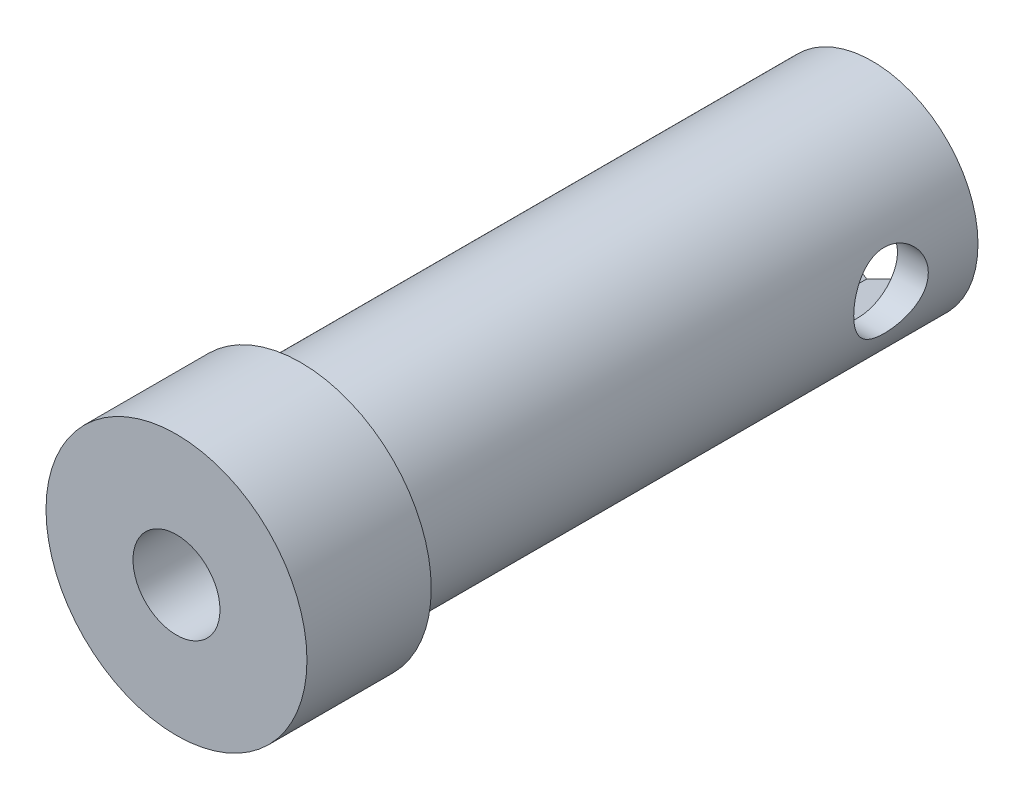
ISO-10303-21;
HEADER;
FILE_DESCRIPTION(('STEP AP214'),'2;1');
FILE_NAME('part.step','',(''),(''),'','','');
FILE_SCHEMA(('AUTOMOTIVE_DESIGN { 1 0 10303 214 1 1 1 1 }'));
ENDSEC;
DATA;
#1=APPLICATION_CONTEXT('core data for automotive mechanical design processes');
#2=APPLICATION_PROTOCOL_DEFINITION('international standard','automotive_design',2000,#1);
#3=PRODUCT_CONTEXT('',#1,'mechanical');
#4=PRODUCT('Part','Part','',(#3));
#5=PRODUCT_RELATED_PRODUCT_CATEGORY('part','',(#4));
#6=PRODUCT_DEFINITION_FORMATION('','',#4);
#7=PRODUCT_DEFINITION_CONTEXT('part definition',#1,'design');
#8=PRODUCT_DEFINITION('design','',#6,#7);
#9=PRODUCT_DEFINITION_SHAPE('','',#8);
#10=(LENGTH_UNIT() NAMED_UNIT(*) SI_UNIT(.MILLI.,.METRE.));
#11=(NAMED_UNIT(*) PLANE_ANGLE_UNIT() SI_UNIT($,.RADIAN.));
#12=(NAMED_UNIT(*) SI_UNIT($,.STERADIAN.) SOLID_ANGLE_UNIT());
#13=UNCERTAINTY_MEASURE_WITH_UNIT(LENGTH_MEASURE(1.E-05),#10,'distance_accuracy_value','');
#14=(GEOMETRIC_REPRESENTATION_CONTEXT(3) GLOBAL_UNCERTAINTY_ASSIGNED_CONTEXT((#13)) GLOBAL_UNIT_ASSIGNED_CONTEXT((#10,
#11,#12)) REPRESENTATION_CONTEXT('',''));
#15=CARTESIAN_POINT('',(0.,0.,0.));
#16=DIRECTION('',(0.,0.,1.));
#17=DIRECTION('',(1.,0.,0.));
#18=AXIS2_PLACEMENT_3D('',#15,#16,#17);
#19=CARTESIAN_POINT('',(2.25,0.,3.5));
#20=DIRECTION('',(1.,0.,0.));
#21=DIRECTION('',(0.,0.,-1.));
#22=AXIS2_PLACEMENT_3D('',#19,#20,#21);
#23=CYLINDRICAL_SURFACE('',#22,1.5);
#24=CARTESIAN_POINT('',(4.25,0.,2.));
#25=CARTESIAN_POINT('',(4.2500010209157,-0.0815655083667399,1.99999856055464));
#26=CARTESIAN_POINT('',(4.24763079702054,-0.163120739629342,2.00667422553748));
#27=CARTESIAN_POINT('',(4.23841044575562,-0.323812547744015,2.03310686808062));
#28=CARTESIAN_POINT('',(4.2315603770681,-0.40294915626383,2.05286367428883));
#29=CARTESIAN_POINT('',(4.2141205688639,-0.556463868995197,2.10468550707371));
#30=CARTESIAN_POINT('',(4.20353753046498,-0.630850219721872,2.1367284874404));
#31=CARTESIAN_POINT('',(4.17969988413846,-0.773190539787241,2.21210770256198));
#32=CARTESIAN_POINT('',(4.16644465546129,-0.841143009135492,2.25544656203501));
#33=CARTESIAN_POINT('',(4.13807832016637,-0.971287267748924,2.35392503513446));
#34=CARTESIAN_POINT('',(4.12291896125755,-1.03319941604949,2.40942020509824));
#35=CARTESIAN_POINT('',(4.09270521060981,-1.14705732806969,2.52988075550396));
#36=CARTESIAN_POINT('',(4.07765084685791,-1.19900052552279,2.59484856689561));
#37=CARTESIAN_POINT('',(4.04880698686655,-1.29312427720224,2.73502531902265));
#38=CARTESIAN_POINT('',(4.03507546976457,-1.33492700758018,2.81050105617882));
#39=CARTESIAN_POINT('',(4.01117354628646,-1.40512349822382,2.96797398290292));
#40=CARTESIAN_POINT('',(4.0010019017598,-1.43352192180918,3.0499688928526));
#41=CARTESIAN_POINT('',(3.9858829929351,-1.4750292626899,3.21495257475405));
#42=CARTESIAN_POINT('',(3.98075571416019,-1.48866689411975,3.29779131424751));
#43=CARTESIAN_POINT('',(3.97577601517782,-1.50191880713281,3.46472780803681));
#44=CARTESIAN_POINT('',(3.97592172401636,-1.50153806269545,3.54882510518631));
#45=CARTESIAN_POINT('',(3.98131493672348,-1.48717164738301,3.71123772076156));
#46=CARTESIAN_POINT('',(3.98629652758993,-1.4738950639563,3.78962617210374));
#47=CARTESIAN_POINT('',(4.00036197260984,-1.43527767348311,3.94298148847549));
#48=CARTESIAN_POINT('',(4.00944637437166,-1.40993525596706,4.01794789528844));
#49=CARTESIAN_POINT('',(4.03086961718048,-1.3474763669417,4.16386558763031));
#50=CARTESIAN_POINT('',(4.04326253509493,-1.31016195807023,4.23472386186851));
#51=CARTESIAN_POINT('',(4.06988590478,-1.22495586763456,4.36938885625305));
#52=CARTESIAN_POINT('',(4.0841169363794,-1.17706084503886,4.43319333945964));
#53=CARTESIAN_POINT('',(4.11383840224644,-1.06872139550984,4.55589788426286));
#54=CARTESIAN_POINT('',(4.12935360736949,-1.00770334727961,4.61428660951452));
#55=CARTESIAN_POINT('',(4.15916674047781,-0.87655524485976,4.72014470411396));
#56=CARTESIAN_POINT('',(4.17346452155981,-0.806424093588433,4.76761275686643));
#57=CARTESIAN_POINT('',(4.19946112552831,-0.657856192770663,4.85076159279324));
#58=CARTESIAN_POINT('',(4.2111258238281,-0.57932790724254,4.88629023618163));
#59=CARTESIAN_POINT('',(4.23029207791539,-0.416896876801657,4.94346879686703));
#60=CARTESIAN_POINT('',(4.23779526295093,-0.332996249551294,4.96512414612633));
#61=CARTESIAN_POINT('',(4.24751560494482,-0.166519502448814,4.99300043312357));
#62=CARTESIAN_POINT('',(4.24996881305308,-0.0840725378489703,4.99991118536298));
#63=CARTESIAN_POINT('',(4.25003056815402,0.0808289065776154,5.00008706130313));
#64=CARTESIAN_POINT('',(4.24764004701629,0.16328338190766,4.99335480973774));
#65=CARTESIAN_POINT('',(4.23843896402726,0.322998150286772,4.96697244574822));
#66=CARTESIAN_POINT('',(4.2317778102469,0.400340003859341,4.94775870798081));
#67=CARTESIAN_POINT('',(4.21485447662064,0.550661054195005,4.8975175507092));
#68=CARTESIAN_POINT('',(4.2045918300867,0.623639684128512,4.86648860012371));
#69=CARTESIAN_POINT('',(4.18113823249899,0.765437512588099,4.79254683615763));
#70=CARTESIAN_POINT('',(4.16787357328707,0.83408386613518,4.74932662914232));
#71=CARTESIAN_POINT('',(4.13990428237041,0.963366301782212,4.65258363079006));
#72=CARTESIAN_POINT('',(4.12519916677669,1.02399967592259,4.59905737149549));
#73=CARTESIAN_POINT('',(4.09504516039956,1.1387745474265,4.47998676439197));
#74=CARTESIAN_POINT('',(4.07959674847471,1.19242452115109,4.41396730711688));
#75=CARTESIAN_POINT('',(4.05045147474101,1.28796171668791,4.27354094799443));
#76=CARTESIAN_POINT('',(4.03675468400403,1.32984846129056,4.19913370604378));
#77=CARTESIAN_POINT('',(4.01276844860528,1.4005686030219,4.0437752419884));
#78=CARTESIAN_POINT('',(4.00248050035801,1.42939626950676,3.96282116530054));
#79=CARTESIAN_POINT('',(3.98669663677319,1.47285262752334,3.79675197037676));
#80=CARTESIAN_POINT('',(3.98119820675466,1.48748877060707,3.71163906050976));
#81=CARTESIAN_POINT('',(3.97592446271836,1.50152432708597,3.54492428134057));
#82=CARTESIAN_POINT('',(3.97583895136912,1.50174959096592,3.46340106714258));
#83=CARTESIAN_POINT('',(3.98062071938137,1.48902781764758,3.30154470015525));
#84=CARTESIAN_POINT('',(3.98548763101594,1.47608175844535,3.2212114594574));
#85=CARTESIAN_POINT('',(3.99938188223679,1.43799776805892,3.06594631621966));
#86=CARTESIAN_POINT('',(4.00830695183632,1.41315878004889,2.99093118905349));
#87=CARTESIAN_POINT('',(4.02926366752764,1.35224508551621,2.84608065020138));
#88=CARTESIAN_POINT('',(4.04129605143985,1.31616771005937,2.77624647378978));
#89=CARTESIAN_POINT('',(4.06782868650947,1.2317922005138,2.64011395168267));
#90=CARTESIAN_POINT('',(4.08241946444022,1.18299198034395,2.57414460356139));
#91=CARTESIAN_POINT('',(4.11207835247002,1.07537148164594,2.45106566697635));
#92=CARTESIAN_POINT('',(4.12714660409913,1.01654820909136,2.39395873560887));
#93=CARTESIAN_POINT('',(4.15688911811243,0.887332086427621,2.28758197879441));
#94=CARTESIAN_POINT('',(4.17151395756386,0.816533541295918,2.23878919099604));
#95=CARTESIAN_POINT('',(4.19797905376782,0.667240948186923,2.15383410720403));
#96=CARTESIAN_POINT('',(4.20981961499931,0.588747743002239,2.11767042992483));
#97=CARTESIAN_POINT('',(4.22931721412351,0.426619084687958,2.0593824576653));
#98=CARTESIAN_POINT('',(4.23699362671968,0.343009496069278,2.03719306491401));
#99=CARTESIAN_POINT('',(4.24733355773892,0.172928713785267,2.00750529765388));
#100=CARTESIAN_POINT('',(4.24999891784007,0.0864585833297923,2.00000152579698));
#101=CARTESIAN_POINT('',(4.25,0.,2.));
#102=B_SPLINE_CURVE_WITH_KNOTS('',3,(#24,#25,#26,#27,#28,#29,#30,#31,#32,#33,#34,#35,#36,#37,
#38,#39,#40,#41,#42,#43,#44,#45,#46,#47,#48,#49,#50,#51,#52,#53,#54,#55,#56,#57,#58,#59,#60,#61,
#62,#63,#64,#65,#66,#67,#68,#69,#70,#71,#72,#73,#74,#75,#76,#77,#78,#79,#80,#81,#82,#83,#84,#85,
#86,#87,#88,#89,#90,#91,#92,#93,#94,#95,#96,#97,#98,#99,#100,#101),.UNSPECIFIED.,.T.,.F.,(4,2,2,
2,2,2,2,2,2,2,2,2,2,2,2,2,2,2,2,2,2,2,2,2,2,2,2,2,2,2,2,2,2,2,2,2,2,2,4),(0.,0.244378011015888,
0.488752820946186,0.732691163485121,0.976686238313035,1.22909954192451,1.48157773636689,
1.74237029797326,2.00307206360573,2.25409069161506,2.5050202544238,2.74289041367082,
2.98079233119384,3.22284994005456,3.46498409277591,3.72140166887643,3.97785014247673,
4.23745243599866,4.49695302237793,4.74401979264808,4.99103903504467,5.22985573929486,
5.46870340128573,5.71421460975224,5.95980857688843,6.21798068295958,6.47616326101998,
6.73445902643867,6.99261909477785,7.23597058627499,7.47930400977472,7.716818677586,
7.95438979432423,8.20332669356905,8.45233808454076,8.7127219459576,8.97307731944662,
9.23221070401172,9.49124883241259),.UNSPECIFIED.);
#103=CARTESIAN_POINT('',(4.25,0.,2.));
#104=VERTEX_POINT('',#103);
#105=EDGE_CURVE('E49',#104,#104,#102,.T.);
#106=ORIENTED_EDGE('',*,*,#105,.F.);
#107=EDGE_LOOP('',(#106));
#108=FACE_BOUND('',#107,.T.);
#109=DIRECTION('',(1.,0.,0.));
#110=VECTOR('',#109,1.);
#111=CARTESIAN_POINT('',(2.25,1.41421356237309,4.));
#112=LINE('',#111,#110);
#113=CARTESIAN_POINT('',(3.09975873007064,1.41421356237309,4.));
#114=VERTEX_POINT('',#113);
#115=CARTESIAN_POINT('',(2.25,1.41421356237309,4.));
#116=VERTEX_POINT('',#115);
#117=EDGE_CURVE('E64',#114,#116,#112,.F.);
#118=ORIENTED_EDGE('',*,*,#117,.F.);
#119=CARTESIAN_POINT('',(3.00651387980422,0.,3.5));
#120=DIRECTION('',(0.997833411031967,-0.0657912139142378,0.));
#121=DIRECTION('',(0.0657912139142378,0.997833411031967,0.));
#122=AXIS2_PLACEMENT_3D('',#119,#120,#121);
#123=ELLIPSE('',#122,1.50325693990211,1.5);
#124=CARTESIAN_POINT('',(2.9132690295378,-1.4142135623731,4.));
#125=VERTEX_POINT('',#124);
#126=EDGE_CURVE('E11',#114,#125,#123,.F.);
#127=ORIENTED_EDGE('',*,*,#126,.T.);
#128=DIRECTION('',(1.,0.,0.));
#129=VECTOR('',#128,1.);
#130=CARTESIAN_POINT('',(2.25,-1.4142135623731,4.));
#131=LINE('',#130,#129);
#132=CARTESIAN_POINT('',(2.25,-1.4142135623731,4.));
#133=VERTEX_POINT('',#132);
#134=EDGE_CURVE('E182',#133,#125,#131,.T.);
#135=ORIENTED_EDGE('',*,*,#134,.F.);
#136=CARTESIAN_POINT('',(2.25,0.,3.5));
#137=DIRECTION('',(1.,0.,0.));
#138=DIRECTION('',(0.,0.,-1.));
#139=AXIS2_PLACEMENT_3D('',#136,#137,#138);
#140=CIRCLE('',#139,1.5);
#141=EDGE_CURVE('E191',#116,#133,#140,.T.);
#142=ORIENTED_EDGE('',*,*,#141,.F.);
#143=EDGE_LOOP('',(#118,#127,#135,#142));
#144=FACE_BOUND('',#143,.T.);
#145=ADVANCED_FACE('F39',(#108,#144),#23,.F.);
#146=CARTESIAN_POINT('',(2.25,0.,3.5));
#147=DIRECTION('',(1.,0.,0.));
#148=DIRECTION('',(0.,0.,-1.));
#149=AXIS2_PLACEMENT_3D('',#146,#147,#148);
#150=PLANE('',#149);
#151=ORIENTED_EDGE('',*,*,#141,.T.);
#152=DIRECTION('',(0.,1.,0.));
#153=VECTOR('',#152,1.);
#154=CARTESIAN_POINT('',(2.25,0.,4.));
#155=LINE('',#154,#153);
#156=EDGE_CURVE('E179',#133,#116,#155,.T.);
#157=ORIENTED_EDGE('',*,*,#156,.T.);
#158=EDGE_LOOP('',(#151,#157));
#159=FACE_BOUND('',#158,.T.);
#160=ADVANCED_FACE('F221',(#159),#150,.T.);
#161=CARTESIAN_POINT('',(0.,0.,0.));
#162=DIRECTION('',(0.,0.,1.));
#163=DIRECTION('',(1.,0.,0.));
#164=AXIS2_PLACEMENT_3D('',#161,#162,#163);
#165=CYLINDRICAL_SURFACE('',#164,1.75);
#166=CARTESIAN_POINT('',(0.,0.,28.));
#167=DIRECTION('',(0.,0.,1.));
#168=DIRECTION('',(1.,0.,0.));
#169=AXIS2_PLACEMENT_3D('',#166,#167,#168);
#170=CIRCLE('',#169,1.75);
#171=CARTESIAN_POINT('',(1.75,0.,28.));
#172=VERTEX_POINT('',#171);
#173=EDGE_CURVE('E187',#172,#172,#170,.T.);
#174=ORIENTED_EDGE('',*,*,#173,.T.);
#175=EDGE_LOOP('',(#174));
#176=FACE_BOUND('',#175,.T.);
#177=CARTESIAN_POINT('',(0.,0.,4.));
#178=DIRECTION('',(0.,0.,-1.));
#179=DIRECTION('',(-1.,0.,0.));
#180=AXIS2_PLACEMENT_3D('',#177,#178,#179);
#181=CIRCLE('',#180,1.75);
#182=CARTESIAN_POINT('',(-1.75,0.,4.));
#183=VERTEX_POINT('',#182);
#184=EDGE_CURVE('E167',#183,#183,#181,.F.);
#185=ORIENTED_EDGE('',*,*,#184,.F.);
#186=EDGE_LOOP('',(#185));
#187=FACE_BOUND('',#186,.T.);
#188=ADVANCED_FACE('F242',(#176,#187),#165,.F.);
#189=CARTESIAN_POINT('',(0.,0.,23.));
#190=DIRECTION('',(0.,0.,-1.));
#191=DIRECTION('',(-1.,0.,0.));
#192=AXIS2_PLACEMENT_3D('',#189,#190,#191);
#193=CYLINDRICAL_SURFACE('',#192,4.25);
#194=ORIENTED_EDGE('',*,*,#105,.T.);
#195=EDGE_LOOP('',(#194));
#196=FACE_BOUND('',#195,.T.);
#197=CARTESIAN_POINT('',(0.,0.,23.));
#198=DIRECTION('',(0.,0.,1.));
#199=DIRECTION('',(1.,0.,0.));
#200=AXIS2_PLACEMENT_3D('',#197,#198,#199);
#201=CIRCLE('',#200,4.25);
#202=CARTESIAN_POINT('',(4.25,0.,23.));
#203=VERTEX_POINT('',#202);
#204=EDGE_CURVE('E204',#203,#203,#201,.T.);
#205=ORIENTED_EDGE('',*,*,#204,.F.);
#206=EDGE_LOOP('',(#205));
#207=FACE_BOUND('',#206,.T.);
#208=CARTESIAN_POINT('',(0.,0.,0.));
#209=DIRECTION('',(0.,0.,1.));
#210=DIRECTION('',(1.,0.,0.));
#211=AXIS2_PLACEMENT_3D('',#208,#209,#210);
#212=CIRCLE('',#211,4.25);
#213=CARTESIAN_POINT('',(4.25,0.,0.));
#214=VERTEX_POINT('',#213);
#215=EDGE_CURVE('E200',#214,#214,#212,.T.);
#216=ORIENTED_EDGE('',*,*,#215,.T.);
#217=EDGE_LOOP('',(#216));
#218=FACE_BOUND('',#217,.T.);
#219=ADVANCED_FACE('F41',(#196,#207,#218),#193,.T.);
#220=CARTESIAN_POINT('',(0.,0.,0.));
#221=DIRECTION('',(0.,0.,1.));
#222=DIRECTION('',(1.,0.,0.));
#223=AXIS2_PLACEMENT_3D('',#220,#221,#222);
#224=PLANE('',#223);
#225=DIRECTION('',(0.831253475741444,-0.55589356811153,0.));
#226=VECTOR('',#225,1.);
#227=CARTESIAN_POINT('',(0.227907450382186,3.45659633079425,0.));
#228=LINE('',#227,#226);
#229=CARTESIAN_POINT('',(0.227907450382186,3.45659633079425,0.));
#230=VERTEX_POINT('',#229);
#231=CARTESIAN_POINT('',(3.107453958287,1.53092452365441,0.));
#232=VERTEX_POINT('',#231);
#233=EDGE_CURVE('E150',#230,#232,#228,.T.);
#234=ORIENTED_EDGE('',*,*,#233,.F.);
#235=DIRECTION('',(0.897044689655682,0.441939842920437,0.));
#236=VECTOR('',#235,1.);
#237=CARTESIAN_POINT('',(-2.87954650790481,1.92567180713984,0.));
#238=LINE('',#237,#236);
#239=CARTESIAN_POINT('',(-2.87954650790481,1.92567180713984,0.));
#240=VERTEX_POINT('',#239);
#241=EDGE_CURVE('E56',#240,#230,#238,.T.);
#242=ORIENTED_EDGE('',*,*,#241,.F.);
#243=DIRECTION('',(0.0657912139142379,0.997833411031967,0.));
#244=VECTOR('',#243,1.);
#245=CARTESIAN_POINT('',(-3.10745395828699,-1.53092452365441,0.));
#246=LINE('',#245,#244);
#247=CARTESIAN_POINT('',(-3.10745395828699,-1.53092452365441,0.));
#248=VERTEX_POINT('',#247);
#249=EDGE_CURVE('E129',#248,#240,#246,.T.);
#250=ORIENTED_EDGE('',*,*,#249,.F.);
#251=DIRECTION('',(-0.831253475741444,0.55589356811153,0.));
#252=VECTOR('',#251,1.);
#253=CARTESIAN_POINT('',(-0.227907450382184,-3.45659633079425,0.));
#254=LINE('',#253,#252);
#255=CARTESIAN_POINT('',(-0.227907450382184,-3.45659633079425,0.));
#256=VERTEX_POINT('',#255);
#257=EDGE_CURVE('E133',#256,#248,#254,.T.);
#258=ORIENTED_EDGE('',*,*,#257,.F.);
#259=DIRECTION('',(-0.897044689655682,-0.441939842920437,0.));
#260=VECTOR('',#259,1.);
#261=CARTESIAN_POINT('',(2.87954650790481,-1.92567180713984,0.));
#262=LINE('',#261,#260);
#263=CARTESIAN_POINT('',(2.87954650790481,-1.92567180713984,0.));
#264=VERTEX_POINT('',#263);
#265=EDGE_CURVE('E157',#264,#256,#262,.T.);
#266=ORIENTED_EDGE('',*,*,#265,.F.);
#267=DIRECTION('',(-0.0657912139142378,-0.997833411031967,0.));
#268=VECTOR('',#267,1.);
#269=CARTESIAN_POINT('',(3.107453958287,1.53092452365441,0.));
#270=LINE('',#269,#268);
#271=EDGE_CURVE('E153',#232,#264,#270,.T.);
#272=ORIENTED_EDGE('',*,*,#271,.F.);
#273=EDGE_LOOP('',(#234,#242,#250,#258,#266,#272));
#274=FACE_BOUND('',#273,.T.);
#275=ORIENTED_EDGE('',*,*,#215,.F.);
#276=EDGE_LOOP('',(#275));
#277=FACE_BOUND('',#276,.T.);
#278=ADVANCED_FACE('F235',(#274,#277),#224,.F.);
#279=CARTESIAN_POINT('',(0.,0.,28.));
#280=DIRECTION('',(0.,0.,-1.));
#281=DIRECTION('',(-1.,0.,0.));
#282=AXIS2_PLACEMENT_3D('',#279,#280,#281);
#283=CYLINDRICAL_SURFACE('',#282,5.25);
#284=CARTESIAN_POINT('',(0.,0.,28.));
#285=DIRECTION('',(0.,0.,1.));
#286=DIRECTION('',(1.,0.,0.));
#287=AXIS2_PLACEMENT_3D('',#284,#285,#286);
#288=CIRCLE('',#287,5.25);
#289=CARTESIAN_POINT('',(5.25,0.,28.));
#290=VERTEX_POINT('',#289);
#291=EDGE_CURVE('E196',#290,#290,#288,.T.);
#292=ORIENTED_EDGE('',*,*,#291,.F.);
#293=EDGE_LOOP('',(#292));
#294=FACE_BOUND('',#293,.T.);
#295=CARTESIAN_POINT('',(0.,0.,23.));
#296=DIRECTION('',(0.,0.,1.));
#297=DIRECTION('',(1.,0.,0.));
#298=AXIS2_PLACEMENT_3D('',#295,#296,#297);
#299=CIRCLE('',#298,5.25);
#300=CARTESIAN_POINT('',(5.25,0.,23.));
#301=VERTEX_POINT('',#300);
#302=EDGE_CURVE('E195',#301,#301,#299,.T.);
#303=ORIENTED_EDGE('',*,*,#302,.T.);
#304=EDGE_LOOP('',(#303));
#305=FACE_BOUND('',#304,.T.);
#306=ADVANCED_FACE('F228',(#294,#305),#283,.T.);
#307=CARTESIAN_POINT('',(0.,0.,28.));
#308=DIRECTION('',(0.,0.,1.));
#309=DIRECTION('',(1.,0.,0.));
#310=AXIS2_PLACEMENT_3D('',#307,#308,#309);
#311=PLANE('',#310);
#312=ORIENTED_EDGE('',*,*,#173,.F.);
#313=EDGE_LOOP('',(#312));
#314=FACE_BOUND('',#313,.T.);
#315=ORIENTED_EDGE('',*,*,#291,.T.);
#316=EDGE_LOOP('',(#315));
#317=FACE_BOUND('',#316,.T.);
#318=ADVANCED_FACE('F224',(#314,#317),#311,.T.);
#319=CARTESIAN_POINT('',(0.,0.,23.));
#320=DIRECTION('',(0.,0.,1.));
#321=DIRECTION('',(1.,0.,0.));
#322=AXIS2_PLACEMENT_3D('',#319,#320,#321);
#323=PLANE('',#322);
#324=ORIENTED_EDGE('',*,*,#204,.T.);
#325=EDGE_LOOP('',(#324));
#326=FACE_BOUND('',#325,.T.);
#327=ORIENTED_EDGE('',*,*,#302,.F.);
#328=EDGE_LOOP('',(#327));
#329=FACE_BOUND('',#328,.T.);
#330=ADVANCED_FACE('F227',(#326,#329),#323,.F.);
#331=CARTESIAN_POINT('',(3.107453958287,1.53092452365441,4.));
#332=DIRECTION('',(0.997833411031967,-0.0657912139142378,0.));
#333=DIRECTION('',(0.0657912139142378,0.997833411031967,0.));
#334=AXIS2_PLACEMENT_3D('',#331,#332,#333);
#335=PLANE('',#334);
#336=DIRECTION('',(-0.0657912139142378,-0.997833411031967,0.));
#337=VECTOR('',#336,1.);
#338=CARTESIAN_POINT('',(3.107453958287,1.53092452365441,4.));
#339=LINE('',#338,#337);
#340=CARTESIAN_POINT('',(3.107453958287,1.53092452365441,4.));
#341=VERTEX_POINT('',#340);
#342=EDGE_CURVE('E136',#341,#114,#339,.T.);
#343=ORIENTED_EDGE('',*,*,#342,.F.);
#344=DIRECTION('',(0.,0.,-1.));
#345=VECTOR('',#344,1.);
#346=CARTESIAN_POINT('',(3.107453958287,1.53092452365441,4.));
#347=LINE('',#346,#345);
#348=EDGE_CURVE('E115',#341,#232,#347,.T.);
#349=ORIENTED_EDGE('',*,*,#348,.T.);
#350=ORIENTED_EDGE('',*,*,#271,.T.);
#351=DIRECTION('',(0.,0.,-1.));
#352=VECTOR('',#351,1.);
#353=CARTESIAN_POINT('',(2.87954650790481,-1.92567180713984,4.));
#354=LINE('',#353,#352);
#355=CARTESIAN_POINT('',(2.87954650790481,-1.92567180713984,4.));
#356=VERTEX_POINT('',#355);
#357=EDGE_CURVE('E174',#356,#264,#354,.T.);
#358=ORIENTED_EDGE('',*,*,#357,.F.);
#359=EDGE_CURVE('E123',#125,#356,#339,.T.);
#360=ORIENTED_EDGE('',*,*,#359,.F.);
#361=ORIENTED_EDGE('',*,*,#126,.F.);
#362=EDGE_LOOP('',(#343,#349,#350,#358,#360,#361));
#363=FACE_BOUND('',#362,.T.);
#364=ADVANCED_FACE('F232',(#363),#335,.F.);
#365=CARTESIAN_POINT('',(0.,0.,4.));
#366=DIRECTION('',(0.,0.,-1.));
#367=DIRECTION('',(-1.,0.,0.));
#368=AXIS2_PLACEMENT_3D('',#365,#366,#367);
#369=PLANE('',#368);
#370=ORIENTED_EDGE('',*,*,#184,.T.);
#371=EDGE_LOOP('',(#370));
#372=FACE_BOUND('',#371,.T.);
#373=ORIENTED_EDGE('',*,*,#117,.T.);
#374=ORIENTED_EDGE('',*,*,#156,.F.);
#375=ORIENTED_EDGE('',*,*,#134,.T.);
#376=ORIENTED_EDGE('',*,*,#359,.T.);
#377=DIRECTION('',(-0.897044689655682,-0.441939842920437,0.));
#378=VECTOR('',#377,1.);
#379=CARTESIAN_POINT('',(2.87954650790481,-1.92567180713984,4.));
#380=LINE('',#379,#378);
#381=CARTESIAN_POINT('',(-0.227907450382184,-3.45659633079425,4.));
#382=VERTEX_POINT('',#381);
#383=EDGE_CURVE('E139',#356,#382,#380,.T.);
#384=ORIENTED_EDGE('',*,*,#383,.T.);
#385=DIRECTION('',(-0.831253475741444,0.55589356811153,0.));
#386=VECTOR('',#385,1.);
#387=CARTESIAN_POINT('',(-0.227907450382184,-3.45659633079425,4.));
#388=LINE('',#387,#386);
#389=CARTESIAN_POINT('',(-3.10745395828699,-1.53092452365441,4.));
#390=VERTEX_POINT('',#389);
#391=EDGE_CURVE('E143',#382,#390,#388,.T.);
#392=ORIENTED_EDGE('',*,*,#391,.T.);
#393=DIRECTION('',(0.0657912139142379,0.997833411031967,0.));
#394=VECTOR('',#393,1.);
#395=CARTESIAN_POINT('',(-3.10745395828699,-1.53092452365441,4.));
#396=LINE('',#395,#394);
#397=CARTESIAN_POINT('',(-2.87954650790481,1.92567180713984,4.));
#398=VERTEX_POINT('',#397);
#399=EDGE_CURVE('E116',#390,#398,#396,.T.);
#400=ORIENTED_EDGE('',*,*,#399,.T.);
#401=DIRECTION('',(0.897044689655682,0.441939842920437,0.));
#402=VECTOR('',#401,1.);
#403=CARTESIAN_POINT('',(-2.87954650790481,1.92567180713984,4.));
#404=LINE('',#403,#402);
#405=CARTESIAN_POINT('',(0.227907450382186,3.45659633079425,4.));
#406=VERTEX_POINT('',#405);
#407=EDGE_CURVE('E109',#398,#406,#404,.T.);
#408=ORIENTED_EDGE('',*,*,#407,.T.);
#409=DIRECTION('',(0.831253475741444,-0.55589356811153,0.));
#410=VECTOR('',#409,1.);
#411=CARTESIAN_POINT('',(0.227907450382186,3.45659633079425,4.));
#412=LINE('',#411,#410);
#413=EDGE_CURVE('E119',#406,#341,#412,.T.);
#414=ORIENTED_EDGE('',*,*,#413,.T.);
#415=ORIENTED_EDGE('',*,*,#342,.T.);
#416=EDGE_LOOP('',(#373,#374,#375,#376,#384,#392,#400,#408,#414,#415));
#417=FACE_BOUND('',#416,.T.);
#418=ADVANCED_FACE('F125',(#372,#417),#369,.T.);
#419=CARTESIAN_POINT('',(-2.87954650790481,1.92567180713984,4.));
#420=DIRECTION('',(-0.441939842920437,0.897044689655682,0.));
#421=DIRECTION('',(-0.897044689655682,-0.441939842920438,0.));
#422=AXIS2_PLACEMENT_3D('',#419,#420,#421);
#423=PLANE('',#422);
#424=ORIENTED_EDGE('',*,*,#241,.T.);
#425=DIRECTION('',(0.,0.,-1.));
#426=VECTOR('',#425,1.);
#427=CARTESIAN_POINT('',(0.227907450382186,3.45659633079425,4.));
#428=LINE('',#427,#426);
#429=EDGE_CURVE('E105',#406,#230,#428,.T.);
#430=ORIENTED_EDGE('',*,*,#429,.F.);
#431=ORIENTED_EDGE('',*,*,#407,.F.);
#432=DIRECTION('',(0.,0.,-1.));
#433=VECTOR('',#432,1.);
#434=CARTESIAN_POINT('',(-2.87954650790481,1.92567180713984,4.));
#435=LINE('',#434,#433);
#436=EDGE_CURVE('E164',#398,#240,#435,.T.);
#437=ORIENTED_EDGE('',*,*,#436,.T.);
#438=EDGE_LOOP('',(#424,#430,#431,#437));
#439=FACE_BOUND('',#438,.T.);
#440=ADVANCED_FACE('F107',(#439),#423,.F.);
#441=CARTESIAN_POINT('',(-3.10745395828699,-1.53092452365441,4.));
#442=DIRECTION('',(-0.997833411031967,0.0657912139142379,0.));
#443=DIRECTION('',(-0.0657912139142379,-0.997833411031967,0.));
#444=AXIS2_PLACEMENT_3D('',#441,#442,#443);
#445=PLANE('',#444);
#446=ORIENTED_EDGE('',*,*,#249,.T.);
#447=ORIENTED_EDGE('',*,*,#436,.F.);
#448=ORIENTED_EDGE('',*,*,#399,.F.);
#449=DIRECTION('',(0.,0.,-1.));
#450=VECTOR('',#449,1.);
#451=CARTESIAN_POINT('',(-3.10745395828699,-1.53092452365441,4.));
#452=LINE('',#451,#450);
#453=EDGE_CURVE('E168',#390,#248,#452,.T.);
#454=ORIENTED_EDGE('',*,*,#453,.T.);
#455=EDGE_LOOP('',(#446,#447,#448,#454));
#456=FACE_BOUND('',#455,.T.);
#457=ADVANCED_FACE('F273',(#456),#445,.F.);
#458=CARTESIAN_POINT('',(-0.227907450382184,-3.45659633079425,4.));
#459=DIRECTION('',(-0.55589356811153,-0.831253475741444,0.));
#460=DIRECTION('',(0.831253475741444,-0.55589356811153,0.));
#461=AXIS2_PLACEMENT_3D('',#458,#459,#460);
#462=PLANE('',#461);
#463=ORIENTED_EDGE('',*,*,#257,.T.);
#464=ORIENTED_EDGE('',*,*,#453,.F.);
#465=ORIENTED_EDGE('',*,*,#391,.F.);
#466=DIRECTION('',(0.,0.,-1.));
#467=VECTOR('',#466,1.);
#468=CARTESIAN_POINT('',(-0.227907450382184,-3.45659633079425,4.));
#469=LINE('',#468,#467);
#470=EDGE_CURVE('E171',#382,#256,#469,.T.);
#471=ORIENTED_EDGE('',*,*,#470,.T.);
#472=EDGE_LOOP('',(#463,#464,#465,#471));
#473=FACE_BOUND('',#472,.T.);
#474=ADVANCED_FACE('F281',(#473),#462,.F.);
#475=CARTESIAN_POINT('',(2.87954650790481,-1.92567180713984,4.));
#476=DIRECTION('',(0.441939842920437,-0.897044689655682,0.));
#477=DIRECTION('',(0.897044689655682,0.441939842920437,0.));
#478=AXIS2_PLACEMENT_3D('',#475,#476,#477);
#479=PLANE('',#478);
#480=ORIENTED_EDGE('',*,*,#265,.T.);
#481=ORIENTED_EDGE('',*,*,#470,.F.);
#482=ORIENTED_EDGE('',*,*,#383,.F.);
#483=ORIENTED_EDGE('',*,*,#357,.T.);
#484=EDGE_LOOP('',(#480,#481,#482,#483));
#485=FACE_BOUND('',#484,.T.);
#486=ADVANCED_FACE('F276',(#485),#479,.F.);
#487=CARTESIAN_POINT('',(0.227907450382186,3.45659633079425,4.));
#488=DIRECTION('',(0.55589356811153,0.831253475741444,0.));
#489=DIRECTION('',(-0.831253475741444,0.55589356811153,0.));
#490=AXIS2_PLACEMENT_3D('',#487,#488,#489);
#491=PLANE('',#490);
#492=ORIENTED_EDGE('',*,*,#233,.T.);
#493=ORIENTED_EDGE('',*,*,#348,.F.);
#494=ORIENTED_EDGE('',*,*,#413,.F.);
#495=ORIENTED_EDGE('',*,*,#429,.T.);
#496=EDGE_LOOP('',(#492,#493,#494,#495));
#497=FACE_BOUND('',#496,.T.);
#498=ADVANCED_FACE('F120',(#497),#491,.F.);
#499=CLOSED_SHELL('',(#145,#160,#188,#219,#278,#306,#318,#330,#364,#418,#440,#457,#474,#486,#498));
#500=MANIFOLD_SOLID_BREP('B2',#499);
#501=ADVANCED_BREP_SHAPE_REPRESENTATION('',(#18,#500),#14);
#502=SHAPE_DEFINITION_REPRESENTATION(#9,#501);
ENDSEC;
END-ISO-10303-21;
